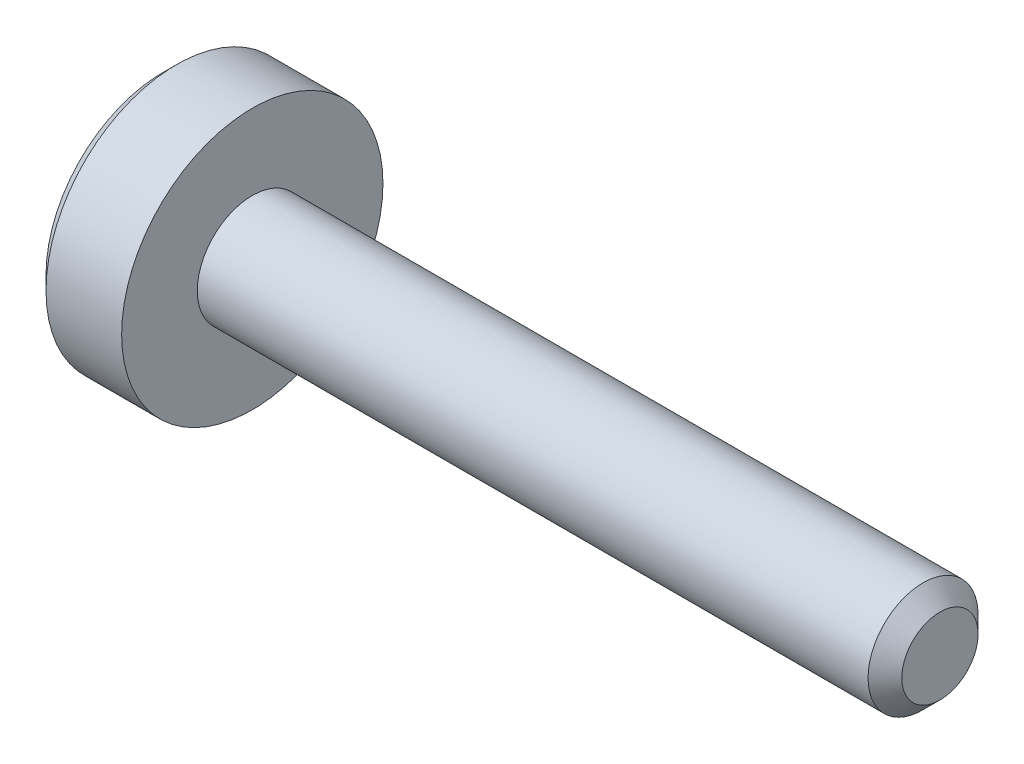
ISO-10303-21;
HEADER;
FILE_DESCRIPTION(('STEP AP214'),'2;1');
FILE_NAME('part.step','',(''),(''),'','','');
FILE_SCHEMA(('AUTOMOTIVE_DESIGN { 1 0 10303 214 1 1 1 1 }'));
ENDSEC;
DATA;
#1=APPLICATION_CONTEXT('core data for automotive mechanical design processes');
#2=APPLICATION_PROTOCOL_DEFINITION('international standard','automotive_design',2000,#1);
#3=PRODUCT_CONTEXT('',#1,'mechanical');
#4=PRODUCT('Part','Part','',(#3));
#5=PRODUCT_RELATED_PRODUCT_CATEGORY('part','',(#4));
#6=PRODUCT_DEFINITION_FORMATION('','',#4);
#7=PRODUCT_DEFINITION_CONTEXT('part definition',#1,'design');
#8=PRODUCT_DEFINITION('design','',#6,#7);
#9=PRODUCT_DEFINITION_SHAPE('','',#8);
#10=(LENGTH_UNIT() NAMED_UNIT(*) SI_UNIT(.MILLI.,.METRE.));
#11=(NAMED_UNIT(*) PLANE_ANGLE_UNIT() SI_UNIT($,.RADIAN.));
#12=(NAMED_UNIT(*) SI_UNIT($,.STERADIAN.) SOLID_ANGLE_UNIT());
#13=UNCERTAINTY_MEASURE_WITH_UNIT(LENGTH_MEASURE(1.E-05),#10,'distance_accuracy_value','');
#14=(GEOMETRIC_REPRESENTATION_CONTEXT(3) GLOBAL_UNCERTAINTY_ASSIGNED_CONTEXT((#13)) GLOBAL_UNIT_ASSIGNED_CONTEXT((#10,
#11,#12)) REPRESENTATION_CONTEXT('',''));
#15=CARTESIAN_POINT('',(0.,0.,0.));
#16=DIRECTION('',(0.,0.,1.));
#17=DIRECTION('',(1.,0.,0.));
#18=AXIS2_PLACEMENT_3D('',#15,#16,#17);
#19=CARTESIAN_POINT('',(-1.3,0.,0.));
#20=DIRECTION('',(1.,0.,0.));
#21=DIRECTION('',(0.,0.,-1.));
#22=AXIS2_PLACEMENT_3D('',#19,#20,#21);
#23=PLANE('',#22);
#24=CARTESIAN_POINT('',(-1.3,0.,0.));
#25=DIRECTION('',(-1.,0.,0.));
#26=DIRECTION('',(0.,0.,1.));
#27=AXIS2_PLACEMENT_3D('',#24,#25,#26);
#28=CIRCLE('',#27,1.7);
#29=CARTESIAN_POINT('',(-1.3,0.,1.7));
#30=VERTEX_POINT('',#29);
#31=EDGE_CURVE('E11',#30,#30,#28,.T.);
#32=ORIENTED_EDGE('',*,*,#31,.T.);
#33=EDGE_LOOP('',(#32));
#34=FACE_BOUND('',#33,.T.);
#35=DIRECTION('',(0.,-1.,0.));
#36=VECTOR('',#35,1.);
#37=CARTESIAN_POINT('',(-1.3,0.37527767497326,0.65));
#38=LINE('',#37,#36);
#39=CARTESIAN_POINT('',(-1.3,0.37527767497326,0.65));
#40=VERTEX_POINT('',#39);
#41=CARTESIAN_POINT('',(-1.3,-0.37527767497326,0.65));
#42=VERTEX_POINT('',#41);
#43=EDGE_CURVE('E53',#40,#42,#38,.T.);
#44=ORIENTED_EDGE('',*,*,#43,.T.);
#45=DIRECTION('',(0.,-0.499999999999993,-0.866025403784442));
#46=VECTOR('',#45,1.);
#47=CARTESIAN_POINT('',(-1.3,-0.37527767497326,0.65));
#48=LINE('',#47,#46);
#49=CARTESIAN_POINT('',(-1.3,-0.75055534994651,0.));
#50=VERTEX_POINT('',#49);
#51=EDGE_CURVE('E124',#42,#50,#48,.T.);
#52=ORIENTED_EDGE('',*,*,#51,.T.);
#53=DIRECTION('',(0.,0.499999999999993,-0.866025403784442));
#54=VECTOR('',#53,1.);
#55=CARTESIAN_POINT('',(-1.3,-0.75055534994651,0.));
#56=LINE('',#55,#54);
#57=CARTESIAN_POINT('',(-1.3,-0.37527767497326,-0.65));
#58=VERTEX_POINT('',#57);
#59=EDGE_CURVE('E127',#50,#58,#56,.T.);
#60=ORIENTED_EDGE('',*,*,#59,.T.);
#61=DIRECTION('',(0.,1.,0.));
#62=VECTOR('',#61,1.);
#63=CARTESIAN_POINT('',(-1.3,-0.37527767497326,-0.65));
#64=LINE('',#63,#62);
#65=CARTESIAN_POINT('',(-1.3,0.37527767497326,-0.65));
#66=VERTEX_POINT('',#65);
#67=EDGE_CURVE('E130',#58,#66,#64,.T.);
#68=ORIENTED_EDGE('',*,*,#67,.T.);
#69=DIRECTION('',(0.,0.499999999999993,0.866025403784442));
#70=VECTOR('',#69,1.);
#71=CARTESIAN_POINT('',(-1.3,0.37527767497326,-0.65));
#72=LINE('',#71,#70);
#73=CARTESIAN_POINT('',(-1.3,0.75055534994651,0.));
#74=VERTEX_POINT('',#73);
#75=EDGE_CURVE('E114',#66,#74,#72,.T.);
#76=ORIENTED_EDGE('',*,*,#75,.T.);
#77=DIRECTION('',(0.,-0.499999999999993,0.866025403784442));
#78=VECTOR('',#77,1.);
#79=CARTESIAN_POINT('',(-1.3,0.75055534994651,0.));
#80=LINE('',#79,#78);
#81=EDGE_CURVE('E133',#74,#40,#80,.T.);
#82=ORIENTED_EDGE('',*,*,#81,.T.);
#83=EDGE_LOOP('',(#44,#52,#60,#68,#76,#82));
#84=FACE_BOUND('',#83,.T.);
#85=ADVANCED_FACE('F39',(#34,#84),#23,.F.);
#86=CARTESIAN_POINT('',(-1.1,0.,0.));
#87=DIRECTION('',(1.,0.,0.));
#88=DIRECTION('',(0.,0.,-1.));
#89=AXIS2_PLACEMENT_3D('',#86,#87,#88);
#90=CONICAL_SURFACE('',#89,1.9,0.785398163397447);
#91=ORIENTED_EDGE('',*,*,#31,.F.);
#92=EDGE_LOOP('',(#91));
#93=FACE_BOUND('',#92,.T.);
#94=CARTESIAN_POINT('',(-1.1,0.,0.));
#95=DIRECTION('',(-1.,0.,0.));
#96=DIRECTION('',(0.,0.,1.));
#97=AXIS2_PLACEMENT_3D('',#94,#95,#96);
#98=CIRCLE('',#97,1.9);
#99=CARTESIAN_POINT('',(-1.1,0.,1.9));
#100=VERTEX_POINT('',#99);
#101=EDGE_CURVE('E46',#100,#100,#98,.T.);
#102=ORIENTED_EDGE('',*,*,#101,.T.);
#103=EDGE_LOOP('',(#102));
#104=FACE_BOUND('',#103,.T.);
#105=ADVANCED_FACE('F158',(#93,#104),#90,.T.);
#106=CARTESIAN_POINT('',(10.,0.,0.));
#107=DIRECTION('',(-1.,0.,0.));
#108=DIRECTION('',(0.,0.,1.));
#109=AXIS2_PLACEMENT_3D('',#106,#107,#108);
#110=CYLINDRICAL_SURFACE('',#109,1.9);
#111=ORIENTED_EDGE('',*,*,#101,.F.);
#112=EDGE_LOOP('',(#111));
#113=FACE_BOUND('',#112,.T.);
#114=CARTESIAN_POINT('',(0.,0.,0.));
#115=DIRECTION('',(-1.,0.,0.));
#116=DIRECTION('',(0.,0.,1.));
#117=AXIS2_PLACEMENT_3D('',#114,#115,#116);
#118=CIRCLE('',#117,1.9);
#119=CARTESIAN_POINT('',(0.,0.,1.9));
#120=VERTEX_POINT('',#119);
#121=EDGE_CURVE('E153',#120,#120,#118,.T.);
#122=ORIENTED_EDGE('',*,*,#121,.T.);
#123=EDGE_LOOP('',(#122));
#124=FACE_BOUND('',#123,.T.);
#125=ADVANCED_FACE('F160',(#113,#124),#110,.T.);
#126=CARTESIAN_POINT('',(0.,1.9,0.));
#127=DIRECTION('',(-1.,0.,0.));
#128=DIRECTION('',(0.,0.,1.));
#129=AXIS2_PLACEMENT_3D('',#126,#127,#128);
#130=PLANE('',#129);
#131=ORIENTED_EDGE('',*,*,#121,.F.);
#132=EDGE_LOOP('',(#131));
#133=FACE_BOUND('',#132,.T.);
#134=CARTESIAN_POINT('',(0.,0.,0.));
#135=DIRECTION('',(-1.,0.,0.));
#136=DIRECTION('',(0.,0.,1.));
#137=AXIS2_PLACEMENT_3D('',#134,#135,#136);
#138=CIRCLE('',#137,0.8);
#139=CARTESIAN_POINT('',(0.,0.,0.8));
#140=VERTEX_POINT('',#139);
#141=EDGE_CURVE('E150',#140,#140,#138,.T.);
#142=ORIENTED_EDGE('',*,*,#141,.T.);
#143=EDGE_LOOP('',(#142));
#144=FACE_BOUND('',#143,.T.);
#145=ADVANCED_FACE('F163',(#133,#144),#130,.F.);
#146=CARTESIAN_POINT('',(10.,0.,0.));
#147=DIRECTION('',(-1.,0.,0.));
#148=DIRECTION('',(0.,0.,1.));
#149=AXIS2_PLACEMENT_3D('',#146,#147,#148);
#150=CYLINDRICAL_SURFACE('',#149,0.800000000000001);
#151=ORIENTED_EDGE('',*,*,#141,.F.);
#152=EDGE_LOOP('',(#151));
#153=FACE_BOUND('',#152,.T.);
#154=CARTESIAN_POINT('',(9.7545,0.,0.));
#155=DIRECTION('',(-1.,0.,0.));
#156=DIRECTION('',(0.,0.,1.));
#157=AXIS2_PLACEMENT_3D('',#154,#155,#156);
#158=CIRCLE('',#157,0.800000000000001);
#159=CARTESIAN_POINT('',(9.7545,0.,0.800000000000001));
#160=VERTEX_POINT('',#159);
#161=EDGE_CURVE('E147',#160,#160,#158,.T.);
#162=ORIENTED_EDGE('',*,*,#161,.T.);
#163=EDGE_LOOP('',(#162));
#164=FACE_BOUND('',#163,.T.);
#165=ADVANCED_FACE('F169',(#153,#164),#150,.T.);
#166=CARTESIAN_POINT('',(10.,0.,0.));
#167=DIRECTION('',(-1.,0.,0.));
#168=DIRECTION('',(0.,0.,1.));
#169=AXIS2_PLACEMENT_3D('',#166,#167,#168);
#170=CONICAL_SURFACE('',#169,0.554500000000002,0.785398163397446);
#171=ORIENTED_EDGE('',*,*,#161,.F.);
#172=EDGE_LOOP('',(#171));
#173=FACE_BOUND('',#172,.T.);
#174=CARTESIAN_POINT('',(10.,0.,0.));
#175=DIRECTION('',(-1.,0.,0.));
#176=DIRECTION('',(0.,0.,1.));
#177=AXIS2_PLACEMENT_3D('',#174,#175,#176);
#178=CIRCLE('',#177,0.554500000000002);
#179=CARTESIAN_POINT('',(10.,0.,0.554500000000002));
#180=VERTEX_POINT('',#179);
#181=EDGE_CURVE('E144',#180,#180,#178,.T.);
#182=ORIENTED_EDGE('',*,*,#181,.T.);
#183=EDGE_LOOP('',(#182));
#184=FACE_BOUND('',#183,.T.);
#185=ADVANCED_FACE('F175',(#173,#184),#170,.T.);
#186=CARTESIAN_POINT('',(10.,0.554500000000002,0.));
#187=DIRECTION('',(-1.,0.,0.));
#188=DIRECTION('',(0.,0.,1.));
#189=AXIS2_PLACEMENT_3D('',#186,#187,#188);
#190=PLANE('',#189);
#191=ORIENTED_EDGE('',*,*,#181,.F.);
#192=EDGE_LOOP('',(#191));
#193=FACE_BOUND('',#192,.T.);
#194=ADVANCED_FACE('F181',(#193),#190,.F.);
#195=CARTESIAN_POINT('',(-0.6,0.37527767497326,0.65));
#196=DIRECTION('',(0.,0.,-1.));
#197=DIRECTION('',(-1.,0.,0.));
#198=AXIS2_PLACEMENT_3D('',#195,#196,#197);
#199=PLANE('',#198);
#200=ORIENTED_EDGE('',*,*,#43,.F.);
#201=DIRECTION('',(-1.,0.,0.));
#202=VECTOR('',#201,1.);
#203=CARTESIAN_POINT('',(-0.6,0.37527767497326,0.65));
#204=LINE('',#203,#202);
#205=CARTESIAN_POINT('',(-0.6,0.37527767497326,0.65));
#206=VERTEX_POINT('',#205);
#207=EDGE_CURVE('E119',#206,#40,#204,.T.);
#208=ORIENTED_EDGE('',*,*,#207,.F.);
#209=DIRECTION('',(0.,-1.,0.));
#210=VECTOR('',#209,1.);
#211=CARTESIAN_POINT('',(-0.6,0.37527767497326,0.65));
#212=LINE('',#211,#210);
#213=CARTESIAN_POINT('',(-0.6,-0.37527767497326,0.65));
#214=VERTEX_POINT('',#213);
#215=EDGE_CURVE('E136',#206,#214,#212,.T.);
#216=ORIENTED_EDGE('',*,*,#215,.T.);
#217=DIRECTION('',(-1.,0.,0.));
#218=VECTOR('',#217,1.);
#219=CARTESIAN_POINT('',(-0.6,-0.37527767497326,0.65));
#220=LINE('',#219,#218);
#221=EDGE_CURVE('E142',#214,#42,#220,.T.);
#222=ORIENTED_EDGE('',*,*,#221,.T.);
#223=EDGE_LOOP('',(#200,#208,#216,#222));
#224=FACE_BOUND('',#223,.T.);
#225=ADVANCED_FACE('F186',(#224),#199,.T.);
#226=CARTESIAN_POINT('',(-0.6,-0.37527767497326,0.65));
#227=DIRECTION('',(0.,0.866025403784442,-0.499999999999993));
#228=DIRECTION('',(0.,0.499999999999993,0.866025403784442));
#229=AXIS2_PLACEMENT_3D('',#226,#227,#228);
#230=PLANE('',#229);
#231=ORIENTED_EDGE('',*,*,#51,.F.);
#232=ORIENTED_EDGE('',*,*,#221,.F.);
#233=DIRECTION('',(0.,-0.499999999999993,-0.866025403784442));
#234=VECTOR('',#233,1.);
#235=CARTESIAN_POINT('',(-0.6,-0.37527767497326,0.65));
#236=LINE('',#235,#234);
#237=CARTESIAN_POINT('',(-0.6,-0.75055534994651,0.));
#238=VERTEX_POINT('',#237);
#239=EDGE_CURVE('E92',#214,#238,#236,.T.);
#240=ORIENTED_EDGE('',*,*,#239,.T.);
#241=DIRECTION('',(-1.,0.,0.));
#242=VECTOR('',#241,1.);
#243=CARTESIAN_POINT('',(-0.6,-0.75055534994651,0.));
#244=LINE('',#243,#242);
#245=EDGE_CURVE('E140',#238,#50,#244,.T.);
#246=ORIENTED_EDGE('',*,*,#245,.T.);
#247=EDGE_LOOP('',(#231,#232,#240,#246));
#248=FACE_BOUND('',#247,.T.);
#249=ADVANCED_FACE('F191',(#248),#230,.T.);
#250=CARTESIAN_POINT('',(-0.6,-0.75055534994651,0.));
#251=DIRECTION('',(0.,0.866025403784442,0.499999999999993));
#252=DIRECTION('',(0.,-0.499999999999993,0.866025403784442));
#253=AXIS2_PLACEMENT_3D('',#250,#251,#252);
#254=PLANE('',#253);
#255=ORIENTED_EDGE('',*,*,#59,.F.);
#256=ORIENTED_EDGE('',*,*,#245,.F.);
#257=DIRECTION('',(0.,0.499999999999993,-0.866025403784442));
#258=VECTOR('',#257,1.);
#259=CARTESIAN_POINT('',(-0.6,-0.75055534994651,0.));
#260=LINE('',#259,#258);
#261=CARTESIAN_POINT('',(-0.6,-0.37527767497326,-0.65));
#262=VERTEX_POINT('',#261);
#263=EDGE_CURVE('E110',#238,#262,#260,.T.);
#264=ORIENTED_EDGE('',*,*,#263,.T.);
#265=DIRECTION('',(-1.,0.,0.));
#266=VECTOR('',#265,1.);
#267=CARTESIAN_POINT('',(-0.6,-0.37527767497326,-0.65));
#268=LINE('',#267,#266);
#269=EDGE_CURVE('E107',#262,#58,#268,.T.);
#270=ORIENTED_EDGE('',*,*,#269,.T.);
#271=EDGE_LOOP('',(#255,#256,#264,#270));
#272=FACE_BOUND('',#271,.T.);
#273=ADVANCED_FACE('F208',(#272),#254,.T.);
#274=CARTESIAN_POINT('',(-0.6,-0.37527767497326,-0.65));
#275=DIRECTION('',(0.,0.,1.));
#276=DIRECTION('',(1.,0.,0.));
#277=AXIS2_PLACEMENT_3D('',#274,#275,#276);
#278=PLANE('',#277);
#279=ORIENTED_EDGE('',*,*,#67,.F.);
#280=ORIENTED_EDGE('',*,*,#269,.F.);
#281=DIRECTION('',(0.,1.,0.));
#282=VECTOR('',#281,1.);
#283=CARTESIAN_POINT('',(-0.6,-0.37527767497326,-0.65));
#284=LINE('',#283,#282);
#285=CARTESIAN_POINT('',(-0.6,0.37527767497326,-0.65));
#286=VERTEX_POINT('',#285);
#287=EDGE_CURVE('E102',#262,#286,#284,.T.);
#288=ORIENTED_EDGE('',*,*,#287,.T.);
#289=DIRECTION('',(-1.,0.,0.));
#290=VECTOR('',#289,1.);
#291=CARTESIAN_POINT('',(-0.6,0.37527767497326,-0.65));
#292=LINE('',#291,#290);
#293=EDGE_CURVE('E106',#286,#66,#292,.T.);
#294=ORIENTED_EDGE('',*,*,#293,.T.);
#295=EDGE_LOOP('',(#279,#280,#288,#294));
#296=FACE_BOUND('',#295,.T.);
#297=ADVANCED_FACE('F105',(#296),#278,.T.);
#298=CARTESIAN_POINT('',(-0.6,0.37527767497326,-0.65));
#299=DIRECTION('',(0.,-0.866025403784442,0.499999999999993));
#300=DIRECTION('',(0.,-0.499999999999993,-0.866025403784442));
#301=AXIS2_PLACEMENT_3D('',#298,#299,#300);
#302=PLANE('',#301);
#303=ORIENTED_EDGE('',*,*,#75,.F.);
#304=ORIENTED_EDGE('',*,*,#293,.F.);
#305=DIRECTION('',(0.,0.499999999999993,0.866025403784442));
#306=VECTOR('',#305,1.);
#307=CARTESIAN_POINT('',(-0.6,0.37527767497326,-0.65));
#308=LINE('',#307,#306);
#309=CARTESIAN_POINT('',(-0.6,0.75055534994651,0.));
#310=VERTEX_POINT('',#309);
#311=EDGE_CURVE('E109',#286,#310,#308,.T.);
#312=ORIENTED_EDGE('',*,*,#311,.T.);
#313=DIRECTION('',(-1.,0.,0.));
#314=VECTOR('',#313,1.);
#315=CARTESIAN_POINT('',(-0.6,0.75055534994651,0.));
#316=LINE('',#315,#314);
#317=EDGE_CURVE('E83',#310,#74,#316,.T.);
#318=ORIENTED_EDGE('',*,*,#317,.T.);
#319=EDGE_LOOP('',(#303,#304,#312,#318));
#320=FACE_BOUND('',#319,.T.);
#321=ADVANCED_FACE('F112',(#320),#302,.T.);
#322=CARTESIAN_POINT('',(-0.6,0.75055534994651,0.));
#323=DIRECTION('',(0.,-0.866025403784442,-0.499999999999993));
#324=DIRECTION('',(0.,0.499999999999993,-0.866025403784442));
#325=AXIS2_PLACEMENT_3D('',#322,#323,#324);
#326=PLANE('',#325);
#327=ORIENTED_EDGE('',*,*,#81,.F.);
#328=ORIENTED_EDGE('',*,*,#317,.F.);
#329=DIRECTION('',(0.,-0.499999999999993,0.866025403784442));
#330=VECTOR('',#329,1.);
#331=CARTESIAN_POINT('',(-0.6,0.75055534994651,0.));
#332=LINE('',#331,#330);
#333=EDGE_CURVE('E61',#310,#206,#332,.T.);
#334=ORIENTED_EDGE('',*,*,#333,.T.);
#335=ORIENTED_EDGE('',*,*,#207,.T.);
#336=EDGE_LOOP('',(#327,#328,#334,#335));
#337=FACE_BOUND('',#336,.T.);
#338=ADVANCED_FACE('F201',(#337),#326,.T.);
#339=CARTESIAN_POINT('',(-0.6,0.,0.));
#340=DIRECTION('',(1.,0.,0.));
#341=DIRECTION('',(0.,0.,-1.));
#342=AXIS2_PLACEMENT_3D('',#339,#340,#341);
#343=PLANE('',#342);
#344=ORIENTED_EDGE('',*,*,#215,.F.);
#345=ORIENTED_EDGE('',*,*,#333,.F.);
#346=ORIENTED_EDGE('',*,*,#311,.F.);
#347=ORIENTED_EDGE('',*,*,#287,.F.);
#348=ORIENTED_EDGE('',*,*,#263,.F.);
#349=ORIENTED_EDGE('',*,*,#239,.F.);
#350=EDGE_LOOP('',(#344,#345,#346,#347,#348,#349));
#351=FACE_BOUND('',#350,.T.);
#352=ADVANCED_FACE('F117',(#351),#343,.F.);
#353=CLOSED_SHELL('',(#85,#105,#125,#145,#165,#185,#194,#225,#249,#273,#297,#321,#338,#352));
#354=MANIFOLD_SOLID_BREP('B2',#353);
#355=ADVANCED_BREP_SHAPE_REPRESENTATION('',(#18,#354),#14);
#356=SHAPE_DEFINITION_REPRESENTATION(#9,#355);
ENDSEC;
END-ISO-10303-21;
